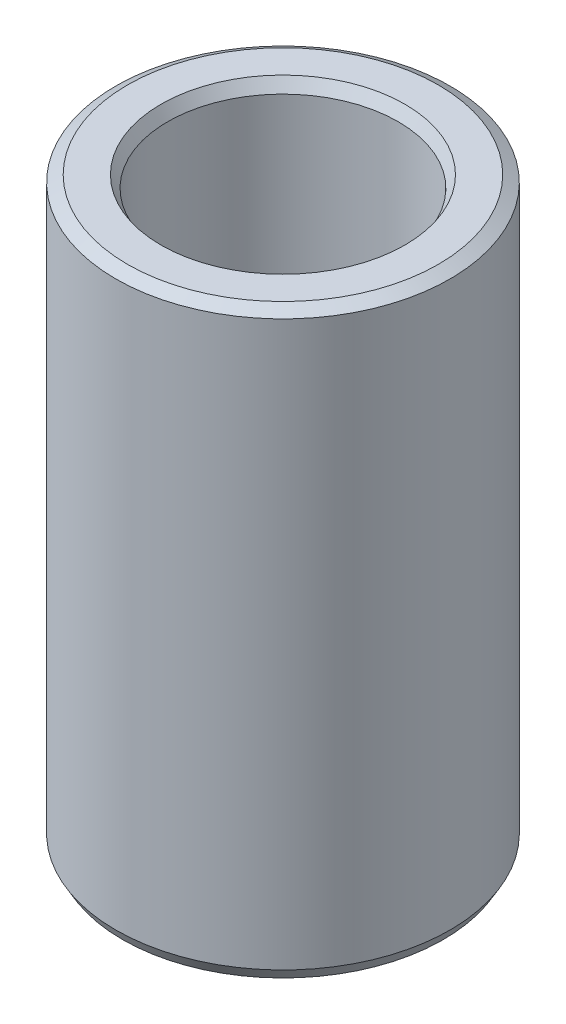
ISO-10303-21;
HEADER;
FILE_DESCRIPTION(('STEP AP214'),'2;1');
FILE_NAME('part.step','',(''),(''),'','','');
FILE_SCHEMA(('AUTOMOTIVE_DESIGN { 1 0 10303 214 1 1 1 1 }'));
ENDSEC;
DATA;
#1=APPLICATION_CONTEXT('core data for automotive mechanical design processes');
#2=APPLICATION_PROTOCOL_DEFINITION('international standard','automotive_design',2000,#1);
#3=PRODUCT_CONTEXT('',#1,'mechanical');
#4=PRODUCT('Part','Part','',(#3));
#5=PRODUCT_RELATED_PRODUCT_CATEGORY('part','',(#4));
#6=PRODUCT_DEFINITION_FORMATION('','',#4);
#7=PRODUCT_DEFINITION_CONTEXT('part definition',#1,'design');
#8=PRODUCT_DEFINITION('design','',#6,#7);
#9=PRODUCT_DEFINITION_SHAPE('','',#8);
#10=(LENGTH_UNIT() NAMED_UNIT(*) SI_UNIT(.MILLI.,.METRE.));
#11=(NAMED_UNIT(*) PLANE_ANGLE_UNIT() SI_UNIT($,.RADIAN.));
#12=(NAMED_UNIT(*) SI_UNIT($,.STERADIAN.) SOLID_ANGLE_UNIT());
#13=UNCERTAINTY_MEASURE_WITH_UNIT(LENGTH_MEASURE(1.E-05),#10,'distance_accuracy_value','');
#14=(GEOMETRIC_REPRESENTATION_CONTEXT(3) GLOBAL_UNCERTAINTY_ASSIGNED_CONTEXT((#13)) GLOBAL_UNIT_ASSIGNED_CONTEXT((#10,
#11,#12)) REPRESENTATION_CONTEXT('',''));
#15=CARTESIAN_POINT('',(0.,0.,0.));
#16=DIRECTION('',(0.,0.,1.));
#17=DIRECTION('',(1.,0.,0.));
#18=AXIS2_PLACEMENT_3D('',#15,#16,#17);
#19=CARTESIAN_POINT('',(0.,130.65832262494,0.));
#20=DIRECTION('',(0.,-1.,0.));
#21=DIRECTION('',(0.,0.,-1.));
#22=AXIS2_PLACEMENT_3D('',#19,#20,#21);
#23=CYLINDRICAL_SURFACE('',#22,37.5);
#24=CARTESIAN_POINT('',(0.,2.62941819552043,0.));
#25=DIRECTION('',(0.,1.,0.));
#26=DIRECTION('',(0.,0.,1.));
#27=AXIS2_PLACEMENT_3D('',#24,#25,#26);
#28=CIRCLE('',#27,37.5);
#29=CARTESIAN_POINT('',(0.,2.62941819552043,37.5));
#30=VERTEX_POINT('',#29);
#31=EDGE_CURVE('E10',#30,#30,#28,.T.);
#32=ORIENTED_EDGE('',*,*,#31,.T.);
#33=EDGE_LOOP('',(#32));
#34=FACE_BOUND('',#33,.T.);
#35=CARTESIAN_POINT('',(0.,129.140227321945,0.));
#36=DIRECTION('',(0.,1.,0.));
#37=DIRECTION('',(0.,0.,1.));
#38=AXIS2_PLACEMENT_3D('',#35,#36,#37);
#39=CIRCLE('',#38,37.5);
#40=CARTESIAN_POINT('',(0.,129.140227321945,37.5));
#41=VERTEX_POINT('',#40);
#42=EDGE_CURVE('E50',#41,#41,#39,.F.);
#43=ORIENTED_EDGE('',*,*,#42,.T.);
#44=EDGE_LOOP('',(#43));
#45=FACE_BOUND('',#44,.T.);
#46=ADVANCED_FACE('F39',(#34,#45),#23,.T.);
#47=CARTESIAN_POINT('',(0.,130.65832262494,0.));
#48=DIRECTION('',(0.,1.,0.));
#49=DIRECTION('',(0.,0.,1.));
#50=AXIS2_PLACEMENT_3D('',#47,#48,#49);
#51=PLANE('',#50);
#52=CARTESIAN_POINT('',(0.,130.65832262494,0.));
#53=DIRECTION('',(0.,1.,0.));
#54=DIRECTION('',(0.,0.,1.));
#55=AXIS2_PLACEMENT_3D('',#52,#53,#54);
#56=CIRCLE('',#55,27.3733268135824);
#57=CARTESIAN_POINT('',(0.,130.65832262494,27.3733268135824));
#58=VERTEX_POINT('',#57);
#59=EDGE_CURVE('E58',#58,#58,#56,.F.);
#60=ORIENTED_EDGE('',*,*,#59,.T.);
#61=EDGE_LOOP('',(#60));
#62=FACE_BOUND('',#61,.T.);
#63=CARTESIAN_POINT('',(0.,130.65832262494,0.));
#64=DIRECTION('',(0.,1.,0.));
#65=DIRECTION('',(0.,0.,1.));
#66=AXIS2_PLACEMENT_3D('',#63,#64,#65);
#67=CIRCLE('',#66,34.8705818044796);
#68=CARTESIAN_POINT('',(0.,130.65832262494,34.8705818044796));
#69=VERTEX_POINT('',#68);
#70=EDGE_CURVE('E61',#69,#69,#67,.T.);
#71=ORIENTED_EDGE('',*,*,#70,.T.);
#72=EDGE_LOOP('',(#71));
#73=FACE_BOUND('',#72,.T.);
#74=ADVANCED_FACE('F88',(#62,#73),#51,.T.);
#75=CARTESIAN_POINT('',(0.,0.,0.));
#76=DIRECTION('',(0.,1.,0.));
#77=DIRECTION('',(0.,0.,1.));
#78=AXIS2_PLACEMENT_3D('',#75,#76,#77);
#79=PLANE('',#78);
#80=CARTESIAN_POINT('',(0.,0.,0.));
#81=DIRECTION('',(0.,1.,0.));
#82=DIRECTION('',(0.,0.,1.));
#83=AXIS2_PLACEMENT_3D('',#80,#81,#82);
#84=CIRCLE('',#83,28.484649706107);
#85=CARTESIAN_POINT('',(0.,0.,28.484649706107));
#86=VERTEX_POINT('',#85);
#87=EDGE_CURVE('E51',#86,#86,#84,.T.);
#88=ORIENTED_EDGE('',*,*,#87,.T.);
#89=EDGE_LOOP('',(#88));
#90=FACE_BOUND('',#89,.T.);
#91=CARTESIAN_POINT('',(0.,0.,0.));
#92=DIRECTION('',(0.,1.,0.));
#93=DIRECTION('',(0.,0.,1.));
#94=AXIS2_PLACEMENT_3D('',#91,#92,#93);
#95=CIRCLE('',#94,35.9819046970042);
#96=CARTESIAN_POINT('',(0.,0.,35.9819046970042));
#97=VERTEX_POINT('',#96);
#98=EDGE_CURVE('E54',#97,#97,#95,.F.);
#99=ORIENTED_EDGE('',*,*,#98,.T.);
#100=EDGE_LOOP('',(#99));
#101=FACE_BOUND('',#100,.T.);
#102=ADVANCED_FACE('F83',(#90,#101),#79,.F.);
#103=CARTESIAN_POINT('',(0.,130.65832262494,0.));
#104=DIRECTION('',(0.,-1.,0.));
#105=DIRECTION('',(0.,0.,-1.));
#106=AXIS2_PLACEMENT_3D('',#103,#104,#105);
#107=CYLINDRICAL_SURFACE('',#106,25.8552315105865);
#108=CARTESIAN_POINT('',(0.,128.02890442942,0.));
#109=DIRECTION('',(0.,1.,0.));
#110=DIRECTION('',(0.,0.,1.));
#111=AXIS2_PLACEMENT_3D('',#108,#109,#110);
#112=CIRCLE('',#111,25.8552315105865);
#113=CARTESIAN_POINT('',(0.,128.02890442942,25.8552315105865));
#114=VERTEX_POINT('',#113);
#115=EDGE_CURVE('E67',#114,#114,#112,.T.);
#116=ORIENTED_EDGE('',*,*,#115,.T.);
#117=EDGE_LOOP('',(#116));
#118=FACE_BOUND('',#117,.T.);
#119=CARTESIAN_POINT('',(0.,1.51809530299588,0.));
#120=DIRECTION('',(0.,1.,0.));
#121=DIRECTION('',(0.,0.,1.));
#122=AXIS2_PLACEMENT_3D('',#119,#120,#121);
#123=CIRCLE('',#122,25.8552315105865);
#124=CARTESIAN_POINT('',(0.,1.51809530299588,25.8552315105865));
#125=VERTEX_POINT('',#124);
#126=EDGE_CURVE('E69',#125,#125,#123,.F.);
#127=ORIENTED_EDGE('',*,*,#126,.T.);
#128=EDGE_LOOP('',(#127));
#129=FACE_BOUND('',#128,.T.);
#130=ADVANCED_FACE('F71',(#118,#129),#107,.F.);
#131=CARTESIAN_POINT('',(0.,128.02890442942,0.));
#132=DIRECTION('',(0.,1.,0.));
#133=DIRECTION('',(0.,0.,1.));
#134=AXIS2_PLACEMENT_3D('',#131,#132,#133);
#135=CONICAL_SURFACE('',#134,25.8552315105865,0.523598775598299);
#136=ORIENTED_EDGE('',*,*,#59,.F.);
#137=EDGE_LOOP('',(#136));
#138=FACE_BOUND('',#137,.T.);
#139=ORIENTED_EDGE('',*,*,#115,.F.);
#140=EDGE_LOOP('',(#139));
#141=FACE_BOUND('',#140,.T.);
#142=ADVANCED_FACE('F77',(#138,#141),#135,.F.);
#143=CARTESIAN_POINT('',(0.,0.,0.));
#144=DIRECTION('',(0.,-1.,0.));
#145=DIRECTION('',(0.,0.,-1.));
#146=AXIS2_PLACEMENT_3D('',#143,#144,#145);
#147=CONICAL_SURFACE('',#146,28.484649706107,1.04719755119659);
#148=ORIENTED_EDGE('',*,*,#126,.F.);
#149=EDGE_LOOP('',(#148));
#150=FACE_BOUND('',#149,.T.);
#151=ORIENTED_EDGE('',*,*,#87,.F.);
#152=EDGE_LOOP('',(#151));
#153=FACE_BOUND('',#152,.T.);
#154=ADVANCED_FACE('F73',(#150,#153),#147,.F.);
#155=CARTESIAN_POINT('',(0.,2.62941819552043,0.));
#156=DIRECTION('',(0.,1.,0.));
#157=DIRECTION('',(0.,0.,1.));
#158=AXIS2_PLACEMENT_3D('',#155,#156,#157);
#159=CONICAL_SURFACE('',#158,37.5,0.523598775598301);
#160=ORIENTED_EDGE('',*,*,#98,.F.);
#161=EDGE_LOOP('',(#160));
#162=FACE_BOUND('',#161,.T.);
#163=ORIENTED_EDGE('',*,*,#31,.F.);
#164=EDGE_LOOP('',(#163));
#165=FACE_BOUND('',#164,.T.);
#166=ADVANCED_FACE('F76',(#162,#165),#159,.T.);
#167=CARTESIAN_POINT('',(0.,130.65832262494,0.));
#168=DIRECTION('',(0.,-1.,0.));
#169=DIRECTION('',(0.,0.,-1.));
#170=AXIS2_PLACEMENT_3D('',#167,#168,#169);
#171=CONICAL_SURFACE('',#170,34.8705818044796,1.04719755119659);
#172=ORIENTED_EDGE('',*,*,#42,.F.);
#173=EDGE_LOOP('',(#172));
#174=FACE_BOUND('',#173,.T.);
#175=ORIENTED_EDGE('',*,*,#70,.F.);
#176=EDGE_LOOP('',(#175));
#177=FACE_BOUND('',#176,.T.);
#178=ADVANCED_FACE('F45',(#174,#177),#171,.T.);
#179=CLOSED_SHELL('',(#46,#74,#102,#130,#142,#154,#166,#178));
#180=MANIFOLD_SOLID_BREP('B2',#179);
#181=ADVANCED_BREP_SHAPE_REPRESENTATION('',(#18,#180),#14);
#182=SHAPE_DEFINITION_REPRESENTATION(#9,#181);
ENDSEC;
END-ISO-10303-21;
